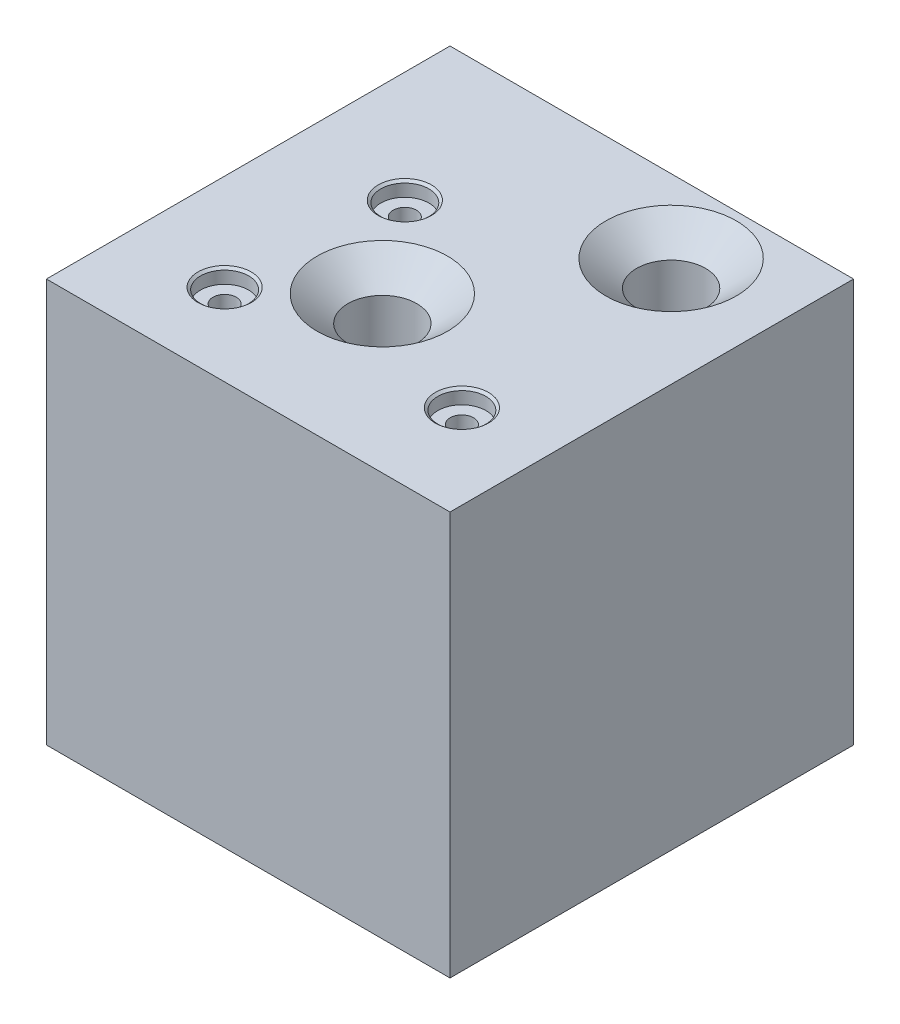
ISO-10303-21;
HEADER;
FILE_DESCRIPTION(('STEP AP214'),'2;1');
FILE_NAME('part.step','',(''),(''),'','','');
FILE_SCHEMA(('AUTOMOTIVE_DESIGN { 1 0 10303 214 1 1 1 1 }'));
ENDSEC;
DATA;
#1=APPLICATION_CONTEXT('core data for automotive mechanical design processes');
#2=APPLICATION_PROTOCOL_DEFINITION('international standard','automotive_design',2000,#1);
#3=PRODUCT_CONTEXT('',#1,'mechanical');
#4=PRODUCT('Part','Part','',(#3));
#5=PRODUCT_RELATED_PRODUCT_CATEGORY('part','',(#4));
#6=PRODUCT_DEFINITION_FORMATION('','',#4);
#7=PRODUCT_DEFINITION_CONTEXT('part definition',#1,'design');
#8=PRODUCT_DEFINITION('design','',#6,#7);
#9=PRODUCT_DEFINITION_SHAPE('','',#8);
#10=(LENGTH_UNIT() NAMED_UNIT(*) SI_UNIT(.MILLI.,.METRE.));
#11=(NAMED_UNIT(*) PLANE_ANGLE_UNIT() SI_UNIT($,.RADIAN.));
#12=(NAMED_UNIT(*) SI_UNIT($,.STERADIAN.) SOLID_ANGLE_UNIT());
#13=UNCERTAINTY_MEASURE_WITH_UNIT(LENGTH_MEASURE(1.E-05),#10,'distance_accuracy_value','');
#14=(GEOMETRIC_REPRESENTATION_CONTEXT(3) GLOBAL_UNCERTAINTY_ASSIGNED_CONTEXT((#13)) GLOBAL_UNIT_ASSIGNED_CONTEXT((#10,
#11,#12)) REPRESENTATION_CONTEXT('',''));
#15=CARTESIAN_POINT('',(0.,0.,0.));
#16=DIRECTION('',(0.,0.,1.));
#17=DIRECTION('',(1.,0.,0.));
#18=AXIS2_PLACEMENT_3D('',#15,#16,#17);
#19=CARTESIAN_POINT('',(-50.,50.,50.));
#20=DIRECTION('',(1.,0.,0.));
#21=DIRECTION('',(0.,0.,-1.));
#22=AXIS2_PLACEMENT_3D('',#19,#20,#21);
#23=PLANE('',#22);
#24=DIRECTION('',(0.,0.,1.));
#25=VECTOR('',#24,1.);
#26=CARTESIAN_POINT('',(-50.,-50.,50.));
#27=LINE('',#26,#25);
#28=CARTESIAN_POINT('',(-50.,-50.,-50.));
#29=VERTEX_POINT('',#28);
#30=CARTESIAN_POINT('',(-50.,-50.,50.));
#31=VERTEX_POINT('',#30);
#32=EDGE_CURVE('E131',#29,#31,#27,.T.);
#33=ORIENTED_EDGE('',*,*,#32,.T.);
#34=DIRECTION('',(0.,-1.,0.));
#35=VECTOR('',#34,1.);
#36=CARTESIAN_POINT('',(-50.,50.,50.));
#37=LINE('',#36,#35);
#38=CARTESIAN_POINT('',(-50.,50.,50.));
#39=VERTEX_POINT('',#38);
#40=EDGE_CURVE('E11',#39,#31,#37,.T.);
#41=ORIENTED_EDGE('',*,*,#40,.F.);
#42=DIRECTION('',(0.,0.,1.));
#43=VECTOR('',#42,1.);
#44=CARTESIAN_POINT('',(-50.,50.,50.));
#45=LINE('',#44,#43);
#46=CARTESIAN_POINT('',(-50.,50.,-50.));
#47=VERTEX_POINT('',#46);
#48=EDGE_CURVE('E132',#47,#39,#45,.T.);
#49=ORIENTED_EDGE('',*,*,#48,.F.);
#50=DIRECTION('',(0.,-1.,0.));
#51=VECTOR('',#50,1.);
#52=CARTESIAN_POINT('',(-50.,50.,-50.));
#53=LINE('',#52,#51);
#54=EDGE_CURVE('E142',#47,#29,#53,.T.);
#55=ORIENTED_EDGE('',*,*,#54,.T.);
#56=EDGE_LOOP('',(#33,#41,#49,#55));
#57=FACE_BOUND('',#56,.T.);
#58=ADVANCED_FACE('F45',(#57),#23,.F.);
#59=CARTESIAN_POINT('',(50.,50.,50.));
#60=DIRECTION('',(0.,0.,-1.));
#61=DIRECTION('',(-1.,0.,0.));
#62=AXIS2_PLACEMENT_3D('',#59,#60,#61);
#63=PLANE('',#62);
#64=DIRECTION('',(1.,0.,0.));
#65=VECTOR('',#64,1.);
#66=CARTESIAN_POINT('',(50.,-50.,50.));
#67=LINE('',#66,#65);
#68=CARTESIAN_POINT('',(50.,-50.,50.));
#69=VERTEX_POINT('',#68);
#70=EDGE_CURVE('E146',#31,#69,#67,.T.);
#71=ORIENTED_EDGE('',*,*,#70,.T.);
#72=DIRECTION('',(0.,-1.,0.));
#73=VECTOR('',#72,1.);
#74=CARTESIAN_POINT('',(50.,50.,50.));
#75=LINE('',#74,#73);
#76=CARTESIAN_POINT('',(50.,50.,50.));
#77=VERTEX_POINT('',#76);
#78=EDGE_CURVE('E54',#77,#69,#75,.T.);
#79=ORIENTED_EDGE('',*,*,#78,.F.);
#80=DIRECTION('',(1.,0.,0.));
#81=VECTOR('',#80,1.);
#82=CARTESIAN_POINT('',(50.,50.,50.));
#83=LINE('',#82,#81);
#84=EDGE_CURVE('E93',#39,#77,#83,.T.);
#85=ORIENTED_EDGE('',*,*,#84,.F.);
#86=ORIENTED_EDGE('',*,*,#40,.T.);
#87=EDGE_LOOP('',(#71,#79,#85,#86));
#88=FACE_BOUND('',#87,.T.);
#89=ADVANCED_FACE('F177',(#88),#63,.F.);
#90=CARTESIAN_POINT('',(50.,50.,50.));
#91=DIRECTION('',(-1.,0.,0.));
#92=DIRECTION('',(0.,0.,1.));
#93=AXIS2_PLACEMENT_3D('',#90,#91,#92);
#94=PLANE('',#93);
#95=DIRECTION('',(0.,0.,-1.));
#96=VECTOR('',#95,1.);
#97=CARTESIAN_POINT('',(50.,-50.,50.));
#98=LINE('',#97,#96);
#99=CARTESIAN_POINT('',(50.,-50.,-50.));
#100=VERTEX_POINT('',#99);
#101=EDGE_CURVE('E80',#69,#100,#98,.T.);
#102=ORIENTED_EDGE('',*,*,#101,.T.);
#103=DIRECTION('',(0.,-1.,0.));
#104=VECTOR('',#103,1.);
#105=CARTESIAN_POINT('',(50.,50.,-50.));
#106=LINE('',#105,#104);
#107=CARTESIAN_POINT('',(50.,50.,-50.));
#108=VERTEX_POINT('',#107);
#109=EDGE_CURVE('E155',#108,#100,#106,.T.);
#110=ORIENTED_EDGE('',*,*,#109,.F.);
#111=DIRECTION('',(0.,0.,-1.));
#112=VECTOR('',#111,1.);
#113=CARTESIAN_POINT('',(50.,50.,50.));
#114=LINE('',#113,#112);
#115=EDGE_CURVE('E137',#77,#108,#114,.T.);
#116=ORIENTED_EDGE('',*,*,#115,.F.);
#117=ORIENTED_EDGE('',*,*,#78,.T.);
#118=EDGE_LOOP('',(#102,#110,#116,#117));
#119=FACE_BOUND('',#118,.T.);
#120=ADVANCED_FACE('F159',(#119),#94,.F.);
#121=CARTESIAN_POINT('',(50.,50.,-50.));
#122=DIRECTION('',(0.,0.,1.));
#123=DIRECTION('',(1.,0.,0.));
#124=AXIS2_PLACEMENT_3D('',#121,#122,#123);
#125=PLANE('',#124);
#126=DIRECTION('',(-1.,0.,0.));
#127=VECTOR('',#126,1.);
#128=CARTESIAN_POINT('',(50.,-50.,-50.));
#129=LINE('',#128,#127);
#130=EDGE_CURVE('E86',#100,#29,#129,.T.);
#131=ORIENTED_EDGE('',*,*,#130,.T.);
#132=ORIENTED_EDGE('',*,*,#54,.F.);
#133=DIRECTION('',(-1.,0.,0.));
#134=VECTOR('',#133,1.);
#135=CARTESIAN_POINT('',(50.,50.,-50.));
#136=LINE('',#135,#134);
#137=EDGE_CURVE('E62',#108,#47,#136,.T.);
#138=ORIENTED_EDGE('',*,*,#137,.F.);
#139=ORIENTED_EDGE('',*,*,#109,.T.);
#140=EDGE_LOOP('',(#131,#132,#138,#139));
#141=FACE_BOUND('',#140,.T.);
#142=ADVANCED_FACE('F166',(#141),#125,.F.);
#143=CARTESIAN_POINT('',(0.,50.,0.));
#144=DIRECTION('',(0.,1.,0.));
#145=DIRECTION('',(0.,0.,1.));
#146=AXIS2_PLACEMENT_3D('',#143,#144,#145);
#147=PLANE('',#146);
#148=CARTESIAN_POINT('',(-22.5043364663405,50.,-11.3110801087369));
#149=DIRECTION('',(0.,1.,0.));
#150=DIRECTION('',(0.,0.,1.));
#151=AXIS2_PLACEMENT_3D('',#148,#149,#150);
#152=CIRCLE('',#151,6.59);
#153=CARTESIAN_POINT('',(-22.5043364663405,50.,-4.72108010873693));
#154=VERTEX_POINT('',#153);
#155=EDGE_CURVE('E391',#154,#154,#152,.T.);
#156=ORIENTED_EDGE('',*,*,#155,.F.);
#157=EDGE_LOOP('',(#156));
#158=FACE_BOUND('',#157,.T.);
#159=CARTESIAN_POINT('',(-26.1568727514534,50.,29.6915852854332));
#160=DIRECTION('',(0.,1.,0.));
#161=DIRECTION('',(0.,0.,1.));
#162=AXIS2_PLACEMENT_3D('',#159,#160,#161);
#163=CIRCLE('',#162,6.59);
#164=CARTESIAN_POINT('',(-26.1568727514534,50.,36.2815852854332));
#165=VERTEX_POINT('',#164);
#166=EDGE_CURVE('E409',#165,#165,#163,.T.);
#167=ORIENTED_EDGE('',*,*,#166,.F.);
#168=EDGE_LOOP('',(#167));
#169=FACE_BOUND('',#168,.T.);
#170=CARTESIAN_POINT('',(29.1024665297702,50.,26.156872751453));
#171=DIRECTION('',(0.,1.,0.));
#172=DIRECTION('',(0.,0.,1.));
#173=AXIS2_PLACEMENT_3D('',#170,#171,#172);
#174=CIRCLE('',#173,6.59);
#175=CARTESIAN_POINT('',(29.1024665297702,50.,32.746872751453));
#176=VERTEX_POINT('',#175);
#177=EDGE_CURVE('E429',#176,#176,#174,.T.);
#178=ORIENTED_EDGE('',*,*,#177,.F.);
#179=EDGE_LOOP('',(#178));
#180=FACE_BOUND('',#179,.T.);
#181=CARTESIAN_POINT('',(22.9756314708712,50.,-31.812412805822));
#182=DIRECTION('',(0.,1.,0.));
#183=DIRECTION('',(0.,0.,1.));
#184=AXIS2_PLACEMENT_3D('',#181,#182,#183);
#185=CIRCLE('',#184,16.155);
#186=CARTESIAN_POINT('',(22.9756314708712,50.,-15.657412805822));
#187=VERTEX_POINT('',#186);
#188=EDGE_CURVE('E120',#187,#187,#185,.T.);
#189=ORIENTED_EDGE('',*,*,#188,.F.);
#190=EDGE_LOOP('',(#189));
#191=FACE_BOUND('',#190,.T.);
#192=CARTESIAN_POINT('',(-5.23154777091059,50.,11.5322348153391));
#193=DIRECTION('',(0.,1.,0.));
#194=DIRECTION('',(0.,0.,1.));
#195=AXIS2_PLACEMENT_3D('',#192,#193,#194);
#196=CIRCLE('',#195,16.155);
#197=CARTESIAN_POINT('',(-5.23154777091059,50.,27.6872348153391));
#198=VERTEX_POINT('',#197);
#199=EDGE_CURVE('E111',#198,#198,#196,.T.);
#200=ORIENTED_EDGE('',*,*,#199,.F.);
#201=EDGE_LOOP('',(#200));
#202=FACE_BOUND('',#201,.T.);
#203=ORIENTED_EDGE('',*,*,#48,.T.);
#204=ORIENTED_EDGE('',*,*,#84,.T.);
#205=ORIENTED_EDGE('',*,*,#115,.T.);
#206=ORIENTED_EDGE('',*,*,#137,.T.);
#207=EDGE_LOOP('',(#203,#204,#205,#206));
#208=FACE_BOUND('',#207,.T.);
#209=ADVANCED_FACE('F168',(#158,#169,#180,#191,#202,#208),#147,.T.);
#210=CARTESIAN_POINT('',(0.,-50.,0.));
#211=DIRECTION('',(0.,1.,0.));
#212=DIRECTION('',(0.,0.,1.));
#213=AXIS2_PLACEMENT_3D('',#210,#211,#212);
#214=PLANE('',#213);
#215=CARTESIAN_POINT('',(-22.5043364663405,-50.,-11.3110801087369));
#216=DIRECTION('',(0.,1.,0.));
#217=DIRECTION('',(0.,0.,1.));
#218=AXIS2_PLACEMENT_3D('',#215,#216,#217);
#219=CIRCLE('',#218,2.89499999999997);
#220=CARTESIAN_POINT('',(-22.5043364663405,-50.,-8.41608010873696));
#221=VERTEX_POINT('',#220);
#222=EDGE_CURVE('E405',#221,#221,#219,.T.);
#223=ORIENTED_EDGE('',*,*,#222,.T.);
#224=EDGE_LOOP('',(#223));
#225=FACE_BOUND('',#224,.T.);
#226=CARTESIAN_POINT('',(-26.1568727514534,-50.,29.6915852854332));
#227=DIRECTION('',(0.,1.,0.));
#228=DIRECTION('',(0.,0.,1.));
#229=AXIS2_PLACEMENT_3D('',#226,#227,#228);
#230=CIRCLE('',#229,2.89499999999997);
#231=CARTESIAN_POINT('',(-26.1568727514534,-50.,32.5865852854332));
#232=VERTEX_POINT('',#231);
#233=EDGE_CURVE('E425',#232,#232,#230,.T.);
#234=ORIENTED_EDGE('',*,*,#233,.T.);
#235=EDGE_LOOP('',(#234));
#236=FACE_BOUND('',#235,.T.);
#237=CARTESIAN_POINT('',(29.1024665297702,-50.,26.156872751453));
#238=DIRECTION('',(0.,1.,0.));
#239=DIRECTION('',(0.,0.,1.));
#240=AXIS2_PLACEMENT_3D('',#237,#238,#239);
#241=CIRCLE('',#240,2.89499999999997);
#242=CARTESIAN_POINT('',(29.1024665297702,-50.,29.051872751453));
#243=VERTEX_POINT('',#242);
#244=EDGE_CURVE('E445',#243,#243,#241,.T.);
#245=ORIENTED_EDGE('',*,*,#244,.T.);
#246=EDGE_LOOP('',(#245));
#247=FACE_BOUND('',#246,.T.);
#248=ORIENTED_EDGE('',*,*,#32,.F.);
#249=ORIENTED_EDGE('',*,*,#130,.F.);
#250=ORIENTED_EDGE('',*,*,#101,.F.);
#251=ORIENTED_EDGE('',*,*,#70,.F.);
#252=EDGE_LOOP('',(#248,#249,#250,#251));
#253=FACE_BOUND('',#252,.T.);
#254=ADVANCED_FACE('F162',(#225,#236,#247,#253),#214,.F.);
#255=CARTESIAN_POINT('',(-5.23154777091059,-0.799999999999995,11.5322348153391));
#256=DIRECTION('',(0.,1.,0.));
#257=DIRECTION('',(0.,0.,1.));
#258=AXIS2_PLACEMENT_3D('',#255,#256,#257);
#259=CONICAL_SURFACE('',#258,8.53499999999999,1.02974425867665);
#260=CARTESIAN_POINT('',(-5.2315477709106,-5.92834538340022,11.5322348153391));
#261=VERTEX_POINT('',#260);
#262=VERTEX_LOOP('',#261);
#263=FACE_BOUND('',#262,.T.);
#264=CARTESIAN_POINT('',(-5.23154777091059,-0.799999999999995,11.5322348153391));
#265=DIRECTION('',(0.,1.,0.));
#266=DIRECTION('',(0.,0.,1.));
#267=AXIS2_PLACEMENT_3D('',#264,#265,#266);
#268=CIRCLE('',#267,8.53499999999999);
#269=CARTESIAN_POINT('',(-5.23154777091059,-0.799999999999995,20.0672348153391));
#270=VERTEX_POINT('',#269);
#271=EDGE_CURVE('E127',#270,#270,#268,.T.);
#272=ORIENTED_EDGE('',*,*,#271,.T.);
#273=EDGE_LOOP('',(#272));
#274=FACE_BOUND('',#273,.T.);
#275=ADVANCED_FACE('F212',(#263,#274),#259,.F.);
#276=CARTESIAN_POINT('',(-5.23154777091059,50.,11.5322348153391));
#277=DIRECTION('',(0.,1.,0.));
#278=DIRECTION('',(0.,0.,1.));
#279=AXIS2_PLACEMENT_3D('',#276,#277,#278);
#280=CYLINDRICAL_SURFACE('',#279,8.53499999999999);
#281=ORIENTED_EDGE('',*,*,#271,.F.);
#282=EDGE_LOOP('',(#281));
#283=FACE_BOUND('',#282,.T.);
#284=CARTESIAN_POINT('',(-5.23154777091059,43.6060608104291,11.5322348153391));
#285=DIRECTION('',(0.,1.,0.));
#286=DIRECTION('',(0.,0.,1.));
#287=AXIS2_PLACEMENT_3D('',#284,#285,#286);
#288=CIRCLE('',#287,8.535);
#289=CARTESIAN_POINT('',(-5.23154777091059,43.6060608104291,20.0672348153391));
#290=VERTEX_POINT('',#289);
#291=EDGE_CURVE('E117',#290,#290,#288,.T.);
#292=ORIENTED_EDGE('',*,*,#291,.T.);
#293=EDGE_LOOP('',(#292));
#294=FACE_BOUND('',#293,.T.);
#295=ADVANCED_FACE('F221',(#283,#294),#280,.F.);
#296=CARTESIAN_POINT('',(-5.23154777091059,50.,11.5322348153391));
#297=DIRECTION('',(0.,1.,0.));
#298=DIRECTION('',(0.,0.,1.));
#299=AXIS2_PLACEMENT_3D('',#296,#297,#298);
#300=CONICAL_SURFACE('',#299,16.155,0.872664625997165);
#301=ORIENTED_EDGE('',*,*,#291,.F.);
#302=EDGE_LOOP('',(#301));
#303=FACE_BOUND('',#302,.T.);
#304=ORIENTED_EDGE('',*,*,#199,.T.);
#305=EDGE_LOOP('',(#304));
#306=FACE_BOUND('',#305,.T.);
#307=ADVANCED_FACE('F104',(#303,#306),#300,.F.);
#308=CARTESIAN_POINT('',(22.9756314708712,-0.799999999999995,-31.812412805822));
#309=DIRECTION('',(0.,1.,0.));
#310=DIRECTION('',(0.,0.,1.));
#311=AXIS2_PLACEMENT_3D('',#308,#309,#310);
#312=CONICAL_SURFACE('',#311,8.53499999999999,1.02974425867665);
#313=CARTESIAN_POINT('',(22.9756314708712,-5.92834538340022,-31.812412805822));
#314=VERTEX_POINT('',#313);
#315=VERTEX_LOOP('',#314);
#316=FACE_BOUND('',#315,.T.);
#317=CARTESIAN_POINT('',(22.9756314708712,-0.799999999999995,-31.812412805822));
#318=DIRECTION('',(0.,1.,0.));
#319=DIRECTION('',(0.,0.,1.));
#320=AXIS2_PLACEMENT_3D('',#317,#318,#319);
#321=CIRCLE('',#320,8.53499999999999);
#322=CARTESIAN_POINT('',(22.9756314708712,-0.799999999999995,-23.277412805822));
#323=VERTEX_POINT('',#322);
#324=EDGE_CURVE('E108',#323,#323,#321,.T.);
#325=ORIENTED_EDGE('',*,*,#324,.T.);
#326=EDGE_LOOP('',(#325));
#327=FACE_BOUND('',#326,.T.);
#328=ADVANCED_FACE('F100',(#316,#327),#312,.F.);
#329=CARTESIAN_POINT('',(22.9756314708712,50.,-31.812412805822));
#330=DIRECTION('',(0.,1.,0.));
#331=DIRECTION('',(0.,0.,1.));
#332=AXIS2_PLACEMENT_3D('',#329,#330,#331);
#333=CYLINDRICAL_SURFACE('',#332,8.535);
#334=ORIENTED_EDGE('',*,*,#324,.F.);
#335=EDGE_LOOP('',(#334));
#336=FACE_BOUND('',#335,.T.);
#337=CARTESIAN_POINT('',(22.9756314708712,43.6060608104291,-31.812412805822));
#338=DIRECTION('',(0.,1.,0.));
#339=DIRECTION('',(0.,0.,1.));
#340=AXIS2_PLACEMENT_3D('',#337,#338,#339);
#341=CIRCLE('',#340,8.535);
#342=CARTESIAN_POINT('',(22.9756314708712,43.6060608104291,-23.277412805822));
#343=VERTEX_POINT('',#342);
#344=EDGE_CURVE('E112',#343,#343,#341,.T.);
#345=ORIENTED_EDGE('',*,*,#344,.T.);
#346=EDGE_LOOP('',(#345));
#347=FACE_BOUND('',#346,.T.);
#348=ADVANCED_FACE('F103',(#336,#347),#333,.F.);
#349=CARTESIAN_POINT('',(22.9756314708712,50.,-31.812412805822));
#350=DIRECTION('',(0.,1.,0.));
#351=DIRECTION('',(0.,0.,1.));
#352=AXIS2_PLACEMENT_3D('',#349,#350,#351);
#353=CONICAL_SURFACE('',#352,16.155,0.872664625997165);
#354=ORIENTED_EDGE('',*,*,#344,.F.);
#355=EDGE_LOOP('',(#354));
#356=FACE_BOUND('',#355,.T.);
#357=ORIENTED_EDGE('',*,*,#188,.T.);
#358=EDGE_LOOP('',(#357));
#359=FACE_BOUND('',#358,.T.);
#360=ADVANCED_FACE('F255',(#356,#359),#353,.F.);
#361=CARTESIAN_POINT('',(29.1024665297702,50.,26.156872751453));
#362=DIRECTION('',(0.,1.,0.));
#363=DIRECTION('',(0.,0.,1.));
#364=AXIS2_PLACEMENT_3D('',#361,#362,#363);
#365=CYLINDRICAL_SURFACE('',#364,2.89499999999999);
#366=ORIENTED_EDGE('',*,*,#244,.F.);
#367=EDGE_LOOP('',(#366));
#368=FACE_BOUND('',#367,.T.);
#369=CARTESIAN_POINT('',(29.1024665297702,46.42,26.156872751453));
#370=DIRECTION('',(0.,1.,0.));
#371=DIRECTION('',(0.,0.,1.));
#372=AXIS2_PLACEMENT_3D('',#369,#370,#371);
#373=CIRCLE('',#372,2.89500000000001);
#374=CARTESIAN_POINT('',(29.1024665297702,46.42,29.051872751453));
#375=VERTEX_POINT('',#374);
#376=EDGE_CURVE('E441',#375,#375,#373,.T.);
#377=ORIENTED_EDGE('',*,*,#376,.T.);
#378=EDGE_LOOP('',(#377));
#379=FACE_BOUND('',#378,.T.);
#380=ADVANCED_FACE('F263',(#368,#379),#365,.F.);
#381=CARTESIAN_POINT('',(35.0574665297702,46.42,26.156872751453));
#382=DIRECTION('',(0.,-1.,0.));
#383=DIRECTION('',(0.,0.,-1.));
#384=AXIS2_PLACEMENT_3D('',#381,#382,#383);
#385=PLANE('',#384);
#386=ORIENTED_EDGE('',*,*,#376,.F.);
#387=EDGE_LOOP('',(#386));
#388=FACE_BOUND('',#387,.T.);
#389=CARTESIAN_POINT('',(29.1024665297702,46.42,26.156872751453));
#390=DIRECTION('',(0.,1.,0.));
#391=DIRECTION('',(0.,0.,1.));
#392=AXIS2_PLACEMENT_3D('',#389,#390,#391);
#393=CIRCLE('',#392,5.95499999999999);
#394=CARTESIAN_POINT('',(29.1024665297702,46.42,32.111872751453));
#395=VERTEX_POINT('',#394);
#396=EDGE_CURVE('E437',#395,#395,#393,.T.);
#397=ORIENTED_EDGE('',*,*,#396,.T.);
#398=EDGE_LOOP('',(#397));
#399=FACE_BOUND('',#398,.T.);
#400=ADVANCED_FACE('F272',(#388,#399),#385,.F.);
#401=CARTESIAN_POINT('',(29.1024665297702,50.,26.156872751453));
#402=DIRECTION('',(0.,1.,0.));
#403=DIRECTION('',(0.,0.,1.));
#404=AXIS2_PLACEMENT_3D('',#401,#402,#403);
#405=CYLINDRICAL_SURFACE('',#404,5.955);
#406=ORIENTED_EDGE('',*,*,#396,.F.);
#407=EDGE_LOOP('',(#406));
#408=FACE_BOUND('',#407,.T.);
#409=CARTESIAN_POINT('',(29.1024665297702,49.4671717342024,26.156872751453));
#410=DIRECTION('',(0.,1.,0.));
#411=DIRECTION('',(0.,0.,1.));
#412=AXIS2_PLACEMENT_3D('',#409,#410,#411);
#413=CIRCLE('',#412,5.955);
#414=CARTESIAN_POINT('',(29.1024665297702,49.4671717342024,32.111872751453));
#415=VERTEX_POINT('',#414);
#416=EDGE_CURVE('E433',#415,#415,#413,.T.);
#417=ORIENTED_EDGE('',*,*,#416,.T.);
#418=EDGE_LOOP('',(#417));
#419=FACE_BOUND('',#418,.T.);
#420=ADVANCED_FACE('F282',(#408,#419),#405,.F.);
#421=CARTESIAN_POINT('',(29.1024665297702,50.,26.156872751453));
#422=DIRECTION('',(0.,1.,0.));
#423=DIRECTION('',(0.,0.,1.));
#424=AXIS2_PLACEMENT_3D('',#421,#422,#423);
#425=CONICAL_SURFACE('',#424,6.59,0.872664625997164);
#426=ORIENTED_EDGE('',*,*,#416,.F.);
#427=EDGE_LOOP('',(#426));
#428=FACE_BOUND('',#427,.T.);
#429=ORIENTED_EDGE('',*,*,#177,.T.);
#430=EDGE_LOOP('',(#429));
#431=FACE_BOUND('',#430,.T.);
#432=ADVANCED_FACE('F292',(#428,#431),#425,.F.);
#433=CARTESIAN_POINT('',(-26.1568727514534,50.,29.6915852854332));
#434=DIRECTION('',(0.,1.,0.));
#435=DIRECTION('',(0.,0.,1.));
#436=AXIS2_PLACEMENT_3D('',#433,#434,#435);
#437=CYLINDRICAL_SURFACE('',#436,2.89499999999999);
#438=ORIENTED_EDGE('',*,*,#233,.F.);
#439=EDGE_LOOP('',(#438));
#440=FACE_BOUND('',#439,.T.);
#441=CARTESIAN_POINT('',(-26.1568727514534,46.42,29.6915852854332));
#442=DIRECTION('',(0.,1.,0.));
#443=DIRECTION('',(0.,0.,1.));
#444=AXIS2_PLACEMENT_3D('',#441,#442,#443);
#445=CIRCLE('',#444,2.89500000000001);
#446=CARTESIAN_POINT('',(-26.1568727514534,46.42,32.5865852854332));
#447=VERTEX_POINT('',#446);
#448=EDGE_CURVE('E421',#447,#447,#445,.T.);
#449=ORIENTED_EDGE('',*,*,#448,.T.);
#450=EDGE_LOOP('',(#449));
#451=FACE_BOUND('',#450,.T.);
#452=ADVANCED_FACE('F302',(#440,#451),#437,.F.);
#453=CARTESIAN_POINT('',(-20.2018727514534,46.42,29.6915852854332));
#454=DIRECTION('',(0.,-1.,0.));
#455=DIRECTION('',(0.,0.,-1.));
#456=AXIS2_PLACEMENT_3D('',#453,#454,#455);
#457=PLANE('',#456);
#458=ORIENTED_EDGE('',*,*,#448,.F.);
#459=EDGE_LOOP('',(#458));
#460=FACE_BOUND('',#459,.T.);
#461=CARTESIAN_POINT('',(-26.1568727514534,46.42,29.6915852854332));
#462=DIRECTION('',(0.,1.,0.));
#463=DIRECTION('',(0.,0.,1.));
#464=AXIS2_PLACEMENT_3D('',#461,#462,#463);
#465=CIRCLE('',#464,5.95499999999999);
#466=CARTESIAN_POINT('',(-26.1568727514534,46.42,35.6465852854332));
#467=VERTEX_POINT('',#466);
#468=EDGE_CURVE('E417',#467,#467,#465,.T.);
#469=ORIENTED_EDGE('',*,*,#468,.T.);
#470=EDGE_LOOP('',(#469));
#471=FACE_BOUND('',#470,.T.);
#472=ADVANCED_FACE('F312',(#460,#471),#457,.F.);
#473=CARTESIAN_POINT('',(-26.1568727514534,50.,29.6915852854332));
#474=DIRECTION('',(0.,1.,0.));
#475=DIRECTION('',(0.,0.,1.));
#476=AXIS2_PLACEMENT_3D('',#473,#474,#475);
#477=CYLINDRICAL_SURFACE('',#476,5.955);
#478=ORIENTED_EDGE('',*,*,#468,.F.);
#479=EDGE_LOOP('',(#478));
#480=FACE_BOUND('',#479,.T.);
#481=CARTESIAN_POINT('',(-26.1568727514534,49.4671717342024,29.6915852854332));
#482=DIRECTION('',(0.,1.,0.));
#483=DIRECTION('',(0.,0.,1.));
#484=AXIS2_PLACEMENT_3D('',#481,#482,#483);
#485=CIRCLE('',#484,5.955);
#486=CARTESIAN_POINT('',(-26.1568727514534,49.4671717342024,35.6465852854332));
#487=VERTEX_POINT('',#486);
#488=EDGE_CURVE('E413',#487,#487,#485,.T.);
#489=ORIENTED_EDGE('',*,*,#488,.T.);
#490=EDGE_LOOP('',(#489));
#491=FACE_BOUND('',#490,.T.);
#492=ADVANCED_FACE('F322',(#480,#491),#477,.F.);
#493=CARTESIAN_POINT('',(-26.1568727514534,50.,29.6915852854332));
#494=DIRECTION('',(0.,1.,0.));
#495=DIRECTION('',(0.,0.,1.));
#496=AXIS2_PLACEMENT_3D('',#493,#494,#495);
#497=CONICAL_SURFACE('',#496,6.59,0.872664625997167);
#498=ORIENTED_EDGE('',*,*,#488,.F.);
#499=EDGE_LOOP('',(#498));
#500=FACE_BOUND('',#499,.T.);
#501=ORIENTED_EDGE('',*,*,#166,.T.);
#502=EDGE_LOOP('',(#501));
#503=FACE_BOUND('',#502,.T.);
#504=ADVANCED_FACE('F332',(#500,#503),#497,.F.);
#505=CARTESIAN_POINT('',(-22.5043364663405,50.,-11.3110801087369));
#506=DIRECTION('',(0.,1.,0.));
#507=DIRECTION('',(0.,0.,1.));
#508=AXIS2_PLACEMENT_3D('',#505,#506,#507);
#509=CYLINDRICAL_SURFACE('',#508,2.89499999999999);
#510=ORIENTED_EDGE('',*,*,#222,.F.);
#511=EDGE_LOOP('',(#510));
#512=FACE_BOUND('',#511,.T.);
#513=CARTESIAN_POINT('',(-22.5043364663405,46.42,-11.3110801087369));
#514=DIRECTION('',(0.,1.,0.));
#515=DIRECTION('',(0.,0.,1.));
#516=AXIS2_PLACEMENT_3D('',#513,#514,#515);
#517=CIRCLE('',#516,2.89500000000001);
#518=CARTESIAN_POINT('',(-22.5043364663405,46.42,-8.41608010873692));
#519=VERTEX_POINT('',#518);
#520=EDGE_CURVE('E401',#519,#519,#517,.T.);
#521=ORIENTED_EDGE('',*,*,#520,.T.);
#522=EDGE_LOOP('',(#521));
#523=FACE_BOUND('',#522,.T.);
#524=ADVANCED_FACE('F342',(#512,#523),#509,.F.);
#525=CARTESIAN_POINT('',(-16.5493364663405,46.42,-11.3110801087369));
#526=DIRECTION('',(0.,-1.,0.));
#527=DIRECTION('',(0.,0.,-1.));
#528=AXIS2_PLACEMENT_3D('',#525,#526,#527);
#529=PLANE('',#528);
#530=ORIENTED_EDGE('',*,*,#520,.F.);
#531=EDGE_LOOP('',(#530));
#532=FACE_BOUND('',#531,.T.);
#533=CARTESIAN_POINT('',(-22.5043364663405,46.42,-11.3110801087369));
#534=DIRECTION('',(0.,1.,0.));
#535=DIRECTION('',(0.,0.,1.));
#536=AXIS2_PLACEMENT_3D('',#533,#534,#535);
#537=CIRCLE('',#536,5.95499999999999);
#538=CARTESIAN_POINT('',(-22.5043364663405,46.42,-5.35608010873694));
#539=VERTEX_POINT('',#538);
#540=EDGE_CURVE('E395',#539,#539,#537,.T.);
#541=ORIENTED_EDGE('',*,*,#540,.T.);
#542=EDGE_LOOP('',(#541));
#543=FACE_BOUND('',#542,.T.);
#544=ADVANCED_FACE('F352',(#532,#543),#529,.F.);
#545=CARTESIAN_POINT('',(-22.5043364663405,50.,-11.3110801087369));
#546=DIRECTION('',(0.,1.,0.));
#547=DIRECTION('',(0.,0.,1.));
#548=AXIS2_PLACEMENT_3D('',#545,#546,#547);
#549=CYLINDRICAL_SURFACE('',#548,5.955);
#550=ORIENTED_EDGE('',*,*,#540,.F.);
#551=EDGE_LOOP('',(#550));
#552=FACE_BOUND('',#551,.T.);
#553=CARTESIAN_POINT('',(-22.5043364663405,49.4671717342024,-11.3110801087369));
#554=DIRECTION('',(0.,1.,0.));
#555=DIRECTION('',(0.,0.,1.));
#556=AXIS2_PLACEMENT_3D('',#553,#554,#555);
#557=CIRCLE('',#556,5.955);
#558=CARTESIAN_POINT('',(-22.5043364663405,49.4671717342024,-5.35608010873693));
#559=VERTEX_POINT('',#558);
#560=EDGE_CURVE('E388',#559,#559,#557,.T.);
#561=ORIENTED_EDGE('',*,*,#560,.T.);
#562=EDGE_LOOP('',(#561));
#563=FACE_BOUND('',#562,.T.);
#564=ADVANCED_FACE('F362',(#552,#563),#549,.F.);
#565=CARTESIAN_POINT('',(-22.5043364663405,50.,-11.3110801087369));
#566=DIRECTION('',(0.,1.,0.));
#567=DIRECTION('',(0.,0.,1.));
#568=AXIS2_PLACEMENT_3D('',#565,#566,#567);
#569=CONICAL_SURFACE('',#568,6.59,0.872664625997167);
#570=ORIENTED_EDGE('',*,*,#560,.F.);
#571=EDGE_LOOP('',(#570));
#572=FACE_BOUND('',#571,.T.);
#573=ORIENTED_EDGE('',*,*,#155,.T.);
#574=EDGE_LOOP('',(#573));
#575=FACE_BOUND('',#574,.T.);
#576=ADVANCED_FACE('F372',(#572,#575),#569,.F.);
#577=CLOSED_SHELL('',(#58,#89,#120,#142,#209,#254,#275,#295,#307,#328,#348,#360,#380,#400,#420,
#432,#452,#472,#492,#504,#524,#544,#564,#576));
#578=MANIFOLD_SOLID_BREP('B2',#577);
#579=ADVANCED_BREP_SHAPE_REPRESENTATION('',(#18,#578),#14);
#580=SHAPE_DEFINITION_REPRESENTATION(#9,#579);
ENDSEC;
END-ISO-10303-21;
